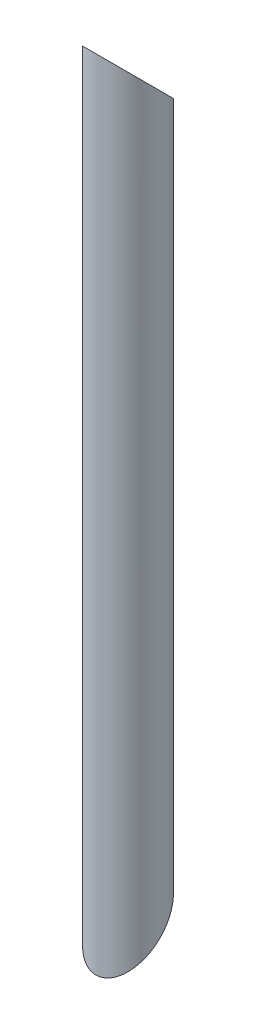
ISO-10303-21;
HEADER;
FILE_DESCRIPTION(('STEP AP214'),'2;1');
FILE_NAME('part.step','',(''),(''),'','','');
FILE_SCHEMA(('AUTOMOTIVE_DESIGN { 1 0 10303 214 1 1 1 1 }'));
ENDSEC;
DATA;
#1=APPLICATION_CONTEXT('core data for automotive mechanical design processes');
#2=APPLICATION_PROTOCOL_DEFINITION('international standard','automotive_design',2000,#1);
#3=PRODUCT_CONTEXT('',#1,'mechanical');
#4=PRODUCT('Part','Part','',(#3));
#5=PRODUCT_RELATED_PRODUCT_CATEGORY('part','',(#4));
#6=PRODUCT_DEFINITION_FORMATION('','',#4);
#7=PRODUCT_DEFINITION_CONTEXT('part definition',#1,'design');
#8=PRODUCT_DEFINITION('design','',#6,#7);
#9=PRODUCT_DEFINITION_SHAPE('','',#8);
#10=(LENGTH_UNIT() NAMED_UNIT(*) SI_UNIT(.MILLI.,.METRE.));
#11=(NAMED_UNIT(*) PLANE_ANGLE_UNIT() SI_UNIT($,.RADIAN.));
#12=(NAMED_UNIT(*) SI_UNIT($,.STERADIAN.) SOLID_ANGLE_UNIT());
#13=UNCERTAINTY_MEASURE_WITH_UNIT(LENGTH_MEASURE(1.E-05),#10,'distance_accuracy_value','');
#14=(GEOMETRIC_REPRESENTATION_CONTEXT(3) GLOBAL_UNCERTAINTY_ASSIGNED_CONTEXT((#13)) GLOBAL_UNIT_ASSIGNED_CONTEXT((#10,
#11,#12)) REPRESENTATION_CONTEXT('',''));
#15=CARTESIAN_POINT('',(0.,0.,0.));
#16=DIRECTION('',(0.,0.,1.));
#17=DIRECTION('',(1.,0.,0.));
#18=AXIS2_PLACEMENT_3D('',#15,#16,#17);
#19=CARTESIAN_POINT('',(2599.99999999996,289.999999999996,275.000000000001));
#20=DIRECTION('',(0.,-0.999999999999999,0.));
#21=DIRECTION('',(0.,0.,1.));
#22=AXIS2_PLACEMENT_3D('',#19,#20,#21);
#23=CYLINDRICAL_SURFACE('',#22,9.64999999999982);
#24=CARTESIAN_POINT('',(2599.99999999996,1.94289029309402E-13,275.000000000001));
#25=DIRECTION('',(0.,-0.707106781186547,-0.707106781186548));
#26=DIRECTION('',(0.,-0.707106781186548,0.707106781186547));
#27=AXIS2_PLACEMENT_3D('',#24,#25,#26);
#28=ELLIPSE('',#27,13.6471608769001,9.64999999999982);
#29=CARTESIAN_POINT('',(2599.99999999996,-9.64999999999963,284.650000000001));
#30=VERTEX_POINT('',#29);
#31=EDGE_CURVE('E48',#30,#30,#28,.T.);
#32=ORIENTED_EDGE('',*,*,#31,.T.);
#33=EDGE_LOOP('',(#32));
#34=FACE_BOUND('',#33,.T.);
#35=CARTESIAN_POINT('',(2599.99999999996,289.999999999996,275.000000000001));
#36=DIRECTION('',(0.,0.707106781186548,-0.707106781186547));
#37=DIRECTION('',(0.,-0.707106781186547,-0.707106781186547));
#38=AXIS2_PLACEMENT_3D('',#35,#36,#37);
#39=ELLIPSE('',#38,13.6471608769001,9.64999999999982);
#40=CARTESIAN_POINT('',(2599.99999999996,280.349999999996,265.350000000001));
#41=VERTEX_POINT('',#40);
#42=EDGE_CURVE('E61',#41,#41,#39,.T.);
#43=ORIENTED_EDGE('',*,*,#42,.T.);
#44=EDGE_LOOP('',(#43));
#45=FACE_BOUND('',#44,.T.);
#46=ADVANCED_FACE('F41',(#34,#45),#23,.F.);
#47=CARTESIAN_POINT('',(2599.99999999996,289.999999999996,275.000000000001));
#48=DIRECTION('',(0.,-0.707106781186548,0.707106781186547));
#49=DIRECTION('',(0.,0.707106781186547,0.707106781186547));
#50=AXIS2_PLACEMENT_3D('',#47,#48,#49);
#51=PLANE('',#50);
#52=ORIENTED_EDGE('',*,*,#42,.F.);
#53=EDGE_LOOP('',(#52));
#54=FACE_BOUND('',#53,.T.);
#55=CARTESIAN_POINT('',(2599.99999999996,289.999999999996,275.000000000001));
#56=DIRECTION('',(0.,0.707106781186548,-0.707106781186547));
#57=DIRECTION('',(0.,-0.707106781186547,-0.707106781186547));
#58=AXIS2_PLACEMENT_3D('',#55,#56,#57);
#59=ELLIPSE('',#58,17.9605122421381,12.6999999999999);
#60=CARTESIAN_POINT('',(2599.99999999996,277.299999999996,262.300000000001));
#61=VERTEX_POINT('',#60);
#62=EDGE_CURVE('E54',#61,#61,#59,.T.);
#63=ORIENTED_EDGE('',*,*,#62,.T.);
#64=EDGE_LOOP('',(#63));
#65=FACE_BOUND('',#64,.T.);
#66=ADVANCED_FACE('F69',(#54,#65),#51,.F.);
#67=CARTESIAN_POINT('',(2599.99999999996,289.999999999996,275.000000000001));
#68=DIRECTION('',(0.,-0.999999999999999,0.));
#69=DIRECTION('',(0.,0.,1.));
#70=AXIS2_PLACEMENT_3D('',#67,#68,#69);
#71=CYLINDRICAL_SURFACE('',#70,12.6999999999999);
#72=CARTESIAN_POINT('',(2599.99999999996,1.94289029309402E-13,275.000000000001));
#73=DIRECTION('',(0.,-0.707106781186547,-0.707106781186548));
#74=DIRECTION('',(0.,-0.707106781186548,0.707106781186547));
#75=AXIS2_PLACEMENT_3D('',#72,#73,#74);
#76=ELLIPSE('',#75,17.9605122421381,12.6999999999999);
#77=CARTESIAN_POINT('',(2599.99999999996,-12.6999999999997,287.700000000001));
#78=VERTEX_POINT('',#77);
#79=EDGE_CURVE('E10',#78,#78,#76,.T.);
#80=ORIENTED_EDGE('',*,*,#79,.F.);
#81=EDGE_LOOP('',(#80));
#82=FACE_BOUND('',#81,.T.);
#83=ORIENTED_EDGE('',*,*,#62,.F.);
#84=EDGE_LOOP('',(#83));
#85=FACE_BOUND('',#84,.T.);
#86=ADVANCED_FACE('F72',(#82,#85),#71,.T.);
#87=CARTESIAN_POINT('',(2599.99999999996,1.38777878078145E-13,275.000000000001));
#88=DIRECTION('',(0.,0.707106781186547,0.707106781186548));
#89=DIRECTION('',(0.,0.707106781186548,-0.707106781186547));
#90=AXIS2_PLACEMENT_3D('',#87,#88,#89);
#91=PLANE('',#90);
#92=ORIENTED_EDGE('',*,*,#31,.F.);
#93=EDGE_LOOP('',(#92));
#94=FACE_BOUND('',#93,.T.);
#95=ORIENTED_EDGE('',*,*,#79,.T.);
#96=EDGE_LOOP('',(#95));
#97=FACE_BOUND('',#96,.T.);
#98=ADVANCED_FACE('F77',(#94,#97),#91,.F.);
#99=CLOSED_SHELL('',(#46,#66,#86,#98));
#100=MANIFOLD_SOLID_BREP('B2',#99);
#101=ADVANCED_BREP_SHAPE_REPRESENTATION('',(#18,#100),#14);
#102=SHAPE_DEFINITION_REPRESENTATION(#9,#101);
ENDSEC;
END-ISO-10303-21;
